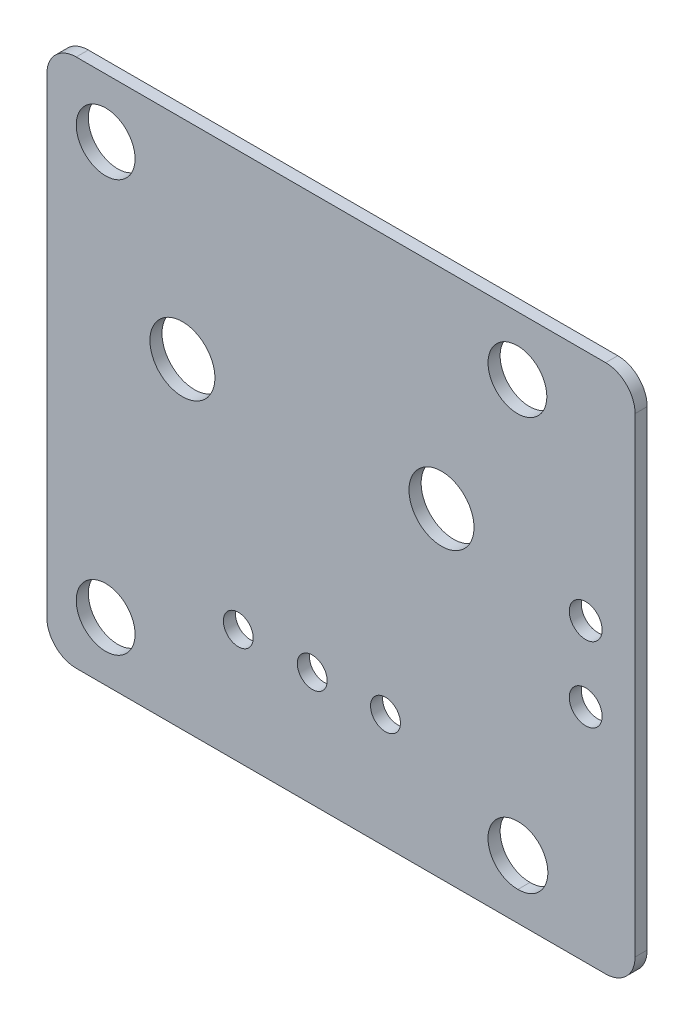
ISO-10303-21;
HEADER;
FILE_DESCRIPTION(('STEP AP214'),'2;1');
FILE_NAME('part.step','',(''),(''),'','','');
FILE_SCHEMA(('AUTOMOTIVE_DESIGN { 1 0 10303 214 1 1 1 1 }'));
ENDSEC;
DATA;
#1=APPLICATION_CONTEXT('core data for automotive mechanical design processes');
#2=APPLICATION_PROTOCOL_DEFINITION('international standard','automotive_design',2000,#1);
#3=PRODUCT_CONTEXT('',#1,'mechanical');
#4=PRODUCT('Part','Part','',(#3));
#5=PRODUCT_RELATED_PRODUCT_CATEGORY('part','',(#4));
#6=PRODUCT_DEFINITION_FORMATION('','',#4);
#7=PRODUCT_DEFINITION_CONTEXT('part definition',#1,'design');
#8=PRODUCT_DEFINITION('design','',#6,#7);
#9=PRODUCT_DEFINITION_SHAPE('','',#8);
#10=(LENGTH_UNIT() NAMED_UNIT(*) SI_UNIT(.MILLI.,.METRE.));
#11=(NAMED_UNIT(*) PLANE_ANGLE_UNIT() SI_UNIT($,.RADIAN.));
#12=(NAMED_UNIT(*) SI_UNIT($,.STERADIAN.) SOLID_ANGLE_UNIT());
#13=UNCERTAINTY_MEASURE_WITH_UNIT(LENGTH_MEASURE(1.E-05),#10,'distance_accuracy_value','');
#14=(GEOMETRIC_REPRESENTATION_CONTEXT(3) GLOBAL_UNCERTAINTY_ASSIGNED_CONTEXT((#13)) GLOBAL_UNIT_ASSIGNED_CONTEXT((#10,
#11,#12)) REPRESENTATION_CONTEXT('',''));
#15=CARTESIAN_POINT('',(0.,0.,0.));
#16=DIRECTION('',(0.,0.,1.));
#17=DIRECTION('',(1.,0.,0.));
#18=AXIS2_PLACEMENT_3D('',#15,#16,#17);
#19=CARTESIAN_POINT('',(-8.99999978,7.99999924,0.41148));
#20=DIRECTION('',(0.,0.,-1.));
#21=DIRECTION('',(-1.,0.,0.));
#22=AXIS2_PLACEMENT_3D('',#19,#20,#21);
#23=CYLINDRICAL_SURFACE('',#22,1.00000054);
#24=CARTESIAN_POINT('',(-8.99999978,7.99999924,0.));
#25=DIRECTION('',(0.,0.,1.));
#26=DIRECTION('',(-1.,0.,0.));
#27=AXIS2_PLACEMENT_3D('',#24,#25,#26);
#28=CIRCLE('',#27,1.00000054);
#29=CARTESIAN_POINT('',(-8.99999978,8.99999978,0.));
#30=VERTEX_POINT('',#29);
#31=CARTESIAN_POINT('',(-10.00000032,7.99999924,0.));
#32=VERTEX_POINT('',#31);
#33=EDGE_CURVE('E154',#30,#32,#28,.T.);
#34=ORIENTED_EDGE('',*,*,#33,.T.);
#35=DIRECTION('',(0.,0.,-1.));
#36=VECTOR('',#35,1.);
#37=CARTESIAN_POINT('',(-10.00000032,7.99999924,0.41148));
#38=LINE('',#37,#36);
#39=CARTESIAN_POINT('',(-10.00000032,7.99999924,0.41148));
#40=VERTEX_POINT('',#39);
#41=EDGE_CURVE('E197',#40,#32,#38,.T.);
#42=ORIENTED_EDGE('',*,*,#41,.F.);
#43=CARTESIAN_POINT('',(-8.99999978,7.99999924,0.41148));
#44=DIRECTION('',(0.,0.,1.));
#45=DIRECTION('',(-1.,0.,0.));
#46=AXIS2_PLACEMENT_3D('',#43,#44,#45);
#47=CIRCLE('',#46,1.00000054);
#48=CARTESIAN_POINT('',(-8.99999978,8.99999978,0.41148));
#49=VERTEX_POINT('',#48);
#50=EDGE_CURVE('E178',#49,#40,#47,.T.);
#51=ORIENTED_EDGE('',*,*,#50,.F.);
#52=DIRECTION('',(0.,0.,-1.));
#53=VECTOR('',#52,1.);
#54=CARTESIAN_POINT('',(-8.99999978,8.99999978,0.41148));
#55=LINE('',#54,#53);
#56=EDGE_CURVE('E150',#49,#30,#55,.T.);
#57=ORIENTED_EDGE('',*,*,#56,.T.);
#58=EDGE_LOOP('',(#34,#42,#51,#57));
#59=FACE_BOUND('',#58,.T.);
#60=ADVANCED_FACE('F41',(#59),#23,.T.);
#61=CARTESIAN_POINT('',(-9.99999778,-7.99999924,0.41148));
#62=DIRECTION('',(0.999999999999987,1.58750015205857E-07,0.));
#63=DIRECTION('',(-1.58750015205857E-07,0.999999999999987,0.));
#64=AXIS2_PLACEMENT_3D('',#61,#62,#63);
#65=PLANE('',#64);
#66=DIRECTION('',(1.58750015205857E-07,-0.999999999999987,0.));
#67=VECTOR('',#66,1.);
#68=CARTESIAN_POINT('',(-9.99999778,-7.99999924,0.));
#69=LINE('',#68,#67);
#70=CARTESIAN_POINT('',(-9.99999778,-7.99999924,0.));
#71=VERTEX_POINT('',#70);
#72=EDGE_CURVE('E158',#32,#71,#69,.T.);
#73=ORIENTED_EDGE('',*,*,#72,.T.);
#74=DIRECTION('',(0.,0.,-1.));
#75=VECTOR('',#74,1.);
#76=CARTESIAN_POINT('',(-9.99999778,-7.99999924,0.41148));
#77=LINE('',#76,#75);
#78=CARTESIAN_POINT('',(-9.99999778,-7.99999924,0.41148));
#79=VERTEX_POINT('',#78);
#80=EDGE_CURVE('E193',#79,#71,#77,.T.);
#81=ORIENTED_EDGE('',*,*,#80,.F.);
#82=DIRECTION('',(1.58750015205857E-07,-0.999999999999987,0.));
#83=VECTOR('',#82,1.);
#84=CARTESIAN_POINT('',(-9.99999778,-7.99999924,0.41148));
#85=LINE('',#84,#83);
#86=EDGE_CURVE('E107',#40,#79,#85,.T.);
#87=ORIENTED_EDGE('',*,*,#86,.F.);
#88=ORIENTED_EDGE('',*,*,#41,.T.);
#89=EDGE_LOOP('',(#73,#81,#87,#88));
#90=FACE_BOUND('',#89,.T.);
#91=ADVANCED_FACE('F245',(#90),#65,.F.);
#92=CARTESIAN_POINT('',(-8.99999978,-7.99999924,0.41148));
#93=DIRECTION('',(0.,0.,-1.));
#94=DIRECTION('',(-1.,0.,0.));
#95=AXIS2_PLACEMENT_3D('',#92,#93,#94);
#96=CYLINDRICAL_SURFACE('',#95,0.999997999999998);
#97=CARTESIAN_POINT('',(-8.99999978,-7.99999924,0.));
#98=DIRECTION('',(0.,0.,1.));
#99=DIRECTION('',(-1.,0.,0.));
#100=AXIS2_PLACEMENT_3D('',#97,#98,#99);
#101=CIRCLE('',#100,0.999997999999998);
#102=CARTESIAN_POINT('',(-8.99999978,-8.99999724,0.));
#103=VERTEX_POINT('',#102);
#104=EDGE_CURVE('E162',#71,#103,#101,.T.);
#105=ORIENTED_EDGE('',*,*,#104,.T.);
#106=DIRECTION('',(0.,0.,-1.));
#107=VECTOR('',#106,1.);
#108=CARTESIAN_POINT('',(-8.99999978,-8.99999724,0.41148));
#109=LINE('',#108,#107);
#110=CARTESIAN_POINT('',(-8.99999978,-8.99999724,0.41148));
#111=VERTEX_POINT('',#110);
#112=EDGE_CURVE('E189',#111,#103,#109,.T.);
#113=ORIENTED_EDGE('',*,*,#112,.F.);
#114=CARTESIAN_POINT('',(-8.99999978,-7.99999924,0.41148));
#115=DIRECTION('',(0.,0.,1.));
#116=DIRECTION('',(-1.,0.,0.));
#117=AXIS2_PLACEMENT_3D('',#114,#115,#116);
#118=CIRCLE('',#117,0.999997999999998);
#119=EDGE_CURVE('E222',#79,#111,#118,.T.);
#120=ORIENTED_EDGE('',*,*,#119,.F.);
#121=ORIENTED_EDGE('',*,*,#80,.T.);
#122=EDGE_LOOP('',(#105,#113,#120,#121));
#123=FACE_BOUND('',#122,.T.);
#124=ADVANCED_FACE('F248',(#123),#96,.T.);
#125=CARTESIAN_POINT('',(8.99999978,-8.99999978,0.41148));
#126=DIRECTION('',(1.41111114671255E-07,0.99999999999999,0.));
#127=DIRECTION('',(-0.99999999999999,1.41111114671255E-07,0.));
#128=AXIS2_PLACEMENT_3D('',#125,#126,#127);
#129=PLANE('',#128);
#130=DIRECTION('',(0.99999999999999,-1.41111114671255E-07,0.));
#131=VECTOR('',#130,1.);
#132=CARTESIAN_POINT('',(8.99999978,-8.99999978,0.));
#133=LINE('',#132,#131);
#134=CARTESIAN_POINT('',(8.99999978,-8.99999978,0.));
#135=VERTEX_POINT('',#134);
#136=EDGE_CURVE('E165',#103,#135,#133,.T.);
#137=ORIENTED_EDGE('',*,*,#136,.T.);
#138=DIRECTION('',(0.,0.,-1.));
#139=VECTOR('',#138,1.);
#140=CARTESIAN_POINT('',(8.99999978,-8.99999978,0.41148));
#141=LINE('',#140,#139);
#142=CARTESIAN_POINT('',(8.99999978,-8.99999978,0.41148));
#143=VERTEX_POINT('',#142);
#144=EDGE_CURVE('E185',#143,#135,#141,.T.);
#145=ORIENTED_EDGE('',*,*,#144,.F.);
#146=DIRECTION('',(0.99999999999999,-1.41111114671255E-07,0.));
#147=VECTOR('',#146,1.);
#148=CARTESIAN_POINT('',(8.99999978,-8.99999978,0.41148));
#149=LINE('',#148,#147);
#150=EDGE_CURVE('E225',#111,#143,#149,.T.);
#151=ORIENTED_EDGE('',*,*,#150,.F.);
#152=ORIENTED_EDGE('',*,*,#112,.T.);
#153=EDGE_LOOP('',(#137,#145,#151,#152));
#154=FACE_BOUND('',#153,.T.);
#155=ADVANCED_FACE('F233',(#154),#129,.F.);
#156=CARTESIAN_POINT('',(8.99999851000081,-8.00000051000081,0.41148));
#157=DIRECTION('',(0.,0.,-1.));
#158=DIRECTION('',(-1.,0.,0.));
#159=AXIS2_PLACEMENT_3D('',#156,#157,#158);
#160=CYLINDRICAL_SURFACE('',#159,0.999999269999999);
#161=CARTESIAN_POINT('',(8.99999851000081,-8.00000051000081,0.));
#162=DIRECTION('',(0.,0.,1.));
#163=DIRECTION('',(-1.,0.,0.));
#164=AXIS2_PLACEMENT_3D('',#161,#162,#163);
#165=CIRCLE('',#164,0.999999269999999);
#166=CARTESIAN_POINT('',(9.99999778,-7.99999924,0.));
#167=VERTEX_POINT('',#166);
#168=EDGE_CURVE('E168',#135,#167,#165,.T.);
#169=ORIENTED_EDGE('',*,*,#168,.T.);
#170=DIRECTION('',(0.,0.,-1.));
#171=VECTOR('',#170,1.);
#172=CARTESIAN_POINT('',(9.99999778,-7.99999924,0.41148));
#173=LINE('',#172,#171);
#174=CARTESIAN_POINT('',(9.99999778,-7.99999924,0.41148));
#175=VERTEX_POINT('',#174);
#176=EDGE_CURVE('E143',#175,#167,#173,.T.);
#177=ORIENTED_EDGE('',*,*,#176,.F.);
#178=CARTESIAN_POINT('',(8.99999851000081,-8.00000051000081,0.41148));
#179=DIRECTION('',(0.,0.,1.));
#180=DIRECTION('',(-1.,0.,0.));
#181=AXIS2_PLACEMENT_3D('',#178,#179,#180);
#182=CIRCLE('',#181,0.999999269999999);
#183=EDGE_CURVE('E129',#143,#175,#182,.T.);
#184=ORIENTED_EDGE('',*,*,#183,.F.);
#185=ORIENTED_EDGE('',*,*,#144,.T.);
#186=EDGE_LOOP('',(#169,#177,#184,#185));
#187=FACE_BOUND('',#186,.T.);
#188=ADVANCED_FACE('F237',(#187),#160,.T.);
#189=CARTESIAN_POINT('',(9.99999778,7.99999924,0.41148));
#190=DIRECTION('',(-1.,0.,0.));
#191=DIRECTION('',(0.,0.,1.));
#192=AXIS2_PLACEMENT_3D('',#189,#190,#191);
#193=PLANE('',#192);
#194=DIRECTION('',(0.,1.,0.));
#195=VECTOR('',#194,1.);
#196=CARTESIAN_POINT('',(9.99999778,7.99999924,0.));
#197=LINE('',#196,#195);
#198=CARTESIAN_POINT('',(9.99999778,7.99999924,0.));
#199=VERTEX_POINT('',#198);
#200=EDGE_CURVE('E139',#167,#199,#197,.T.);
#201=ORIENTED_EDGE('',*,*,#200,.T.);
#202=DIRECTION('',(0.,0.,-1.));
#203=VECTOR('',#202,1.);
#204=CARTESIAN_POINT('',(9.99999778,7.99999924,0.41148));
#205=LINE('',#204,#203);
#206=CARTESIAN_POINT('',(9.99999778,7.99999924,0.41148));
#207=VERTEX_POINT('',#206);
#208=EDGE_CURVE('E136',#207,#199,#205,.T.);
#209=ORIENTED_EDGE('',*,*,#208,.F.);
#210=DIRECTION('',(0.,1.,0.));
#211=VECTOR('',#210,1.);
#212=CARTESIAN_POINT('',(9.99999778,7.99999924,0.41148));
#213=LINE('',#212,#211);
#214=EDGE_CURVE('E122',#175,#207,#213,.T.);
#215=ORIENTED_EDGE('',*,*,#214,.F.);
#216=ORIENTED_EDGE('',*,*,#176,.T.);
#217=EDGE_LOOP('',(#201,#209,#215,#216));
#218=FACE_BOUND('',#217,.T.);
#219=ADVANCED_FACE('F137',(#218),#193,.F.);
#220=CARTESIAN_POINT('',(8.99999978,7.99999924,0.41148));
#221=DIRECTION('',(0.,0.,-1.));
#222=DIRECTION('',(-1.,0.,0.));
#223=AXIS2_PLACEMENT_3D('',#220,#221,#222);
#224=CYLINDRICAL_SURFACE('',#223,0.999997999999998);
#225=CARTESIAN_POINT('',(8.99999978,7.99999924,0.));
#226=DIRECTION('',(0.,0.,1.));
#227=DIRECTION('',(-1.,0.,0.));
#228=AXIS2_PLACEMENT_3D('',#225,#226,#227);
#229=CIRCLE('',#228,0.999997999999998);
#230=CARTESIAN_POINT('',(8.99999978,8.99999724,0.));
#231=VERTEX_POINT('',#230);
#232=EDGE_CURVE('E173',#199,#231,#229,.T.);
#233=ORIENTED_EDGE('',*,*,#232,.T.);
#234=DIRECTION('',(0.,0.,-1.));
#235=VECTOR('',#234,1.);
#236=CARTESIAN_POINT('',(8.99999978,8.99999724,0.41148));
#237=LINE('',#236,#235);
#238=CARTESIAN_POINT('',(8.99999978,8.99999724,0.41148));
#239=VERTEX_POINT('',#238);
#240=EDGE_CURVE('E144',#239,#231,#237,.T.);
#241=ORIENTED_EDGE('',*,*,#240,.F.);
#242=CARTESIAN_POINT('',(8.99999978,7.99999924,0.41148));
#243=DIRECTION('',(0.,0.,1.));
#244=DIRECTION('',(-1.,0.,0.));
#245=AXIS2_PLACEMENT_3D('',#242,#243,#244);
#246=CIRCLE('',#245,0.999997999999998);
#247=EDGE_CURVE('E126',#207,#239,#246,.T.);
#248=ORIENTED_EDGE('',*,*,#247,.F.);
#249=ORIENTED_EDGE('',*,*,#208,.T.);
#250=EDGE_LOOP('',(#233,#241,#248,#249));
#251=FACE_BOUND('',#250,.T.);
#252=ADVANCED_FACE('F146',(#251),#224,.T.);
#253=CARTESIAN_POINT('',(-8.99999978,8.99999978,0.41148));
#254=DIRECTION('',(-1.41111114671255E-07,-0.99999999999999,0.));
#255=DIRECTION('',(0.99999999999999,-1.41111114671255E-07,0.));
#256=AXIS2_PLACEMENT_3D('',#253,#254,#255);
#257=PLANE('',#256);
#258=DIRECTION('',(-0.99999999999999,1.41111114671255E-07,0.));
#259=VECTOR('',#258,1.);
#260=CARTESIAN_POINT('',(-8.99999978,8.99999978,0.));
#261=LINE('',#260,#259);
#262=EDGE_CURVE('E98',#231,#30,#261,.T.);
#263=ORIENTED_EDGE('',*,*,#262,.T.);
#264=ORIENTED_EDGE('',*,*,#56,.F.);
#265=DIRECTION('',(-0.99999999999999,1.41111114671255E-07,0.));
#266=VECTOR('',#265,1.);
#267=CARTESIAN_POINT('',(-8.99999978,8.99999978,0.41148));
#268=LINE('',#267,#266);
#269=EDGE_CURVE('E65',#239,#49,#268,.T.);
#270=ORIENTED_EDGE('',*,*,#269,.F.);
#271=ORIENTED_EDGE('',*,*,#240,.T.);
#272=EDGE_LOOP('',(#263,#264,#270,#271));
#273=FACE_BOUND('',#272,.T.);
#274=ADVANCED_FACE('F241',(#273),#257,.F.);
#275=CARTESIAN_POINT('',(-8.99999978,7.99999924,0.41148));
#276=DIRECTION('',(0.,0.,-1.));
#277=DIRECTION('',(-1.,0.,0.));
#278=AXIS2_PLACEMENT_3D('',#275,#276,#277);
#279=PLANE('',#278);
#280=CARTESIAN_POINT('',(-7.99999924,6.9999987,0.41148));
#281=DIRECTION('',(0.,0.,1.));
#282=DIRECTION('',(1.,0.,0.));
#283=AXIS2_PLACEMENT_3D('',#280,#281,#282);
#284=CIRCLE('',#283,0.999998);
#285=CARTESIAN_POINT('',(-7.00000124,6.9999987,0.41148));
#286=VERTEX_POINT('',#285);
#287=EDGE_CURVE('E450',#286,#286,#284,.T.);
#288=ORIENTED_EDGE('',*,*,#287,.F.);
#289=EDGE_LOOP('',(#288));
#290=FACE_BOUND('',#289,.T.);
#291=CARTESIAN_POINT('',(-7.99999924,-6.9999987,0.41148));
#292=DIRECTION('',(0.,0.,1.));
#293=DIRECTION('',(1.,0.,0.));
#294=AXIS2_PLACEMENT_3D('',#291,#292,#293);
#295=CIRCLE('',#294,0.999998);
#296=CARTESIAN_POINT('',(-7.00000124,-6.9999987,0.41148));
#297=VERTEX_POINT('',#296);
#298=EDGE_CURVE('E454',#297,#297,#295,.T.);
#299=ORIENTED_EDGE('',*,*,#298,.F.);
#300=EDGE_LOOP('',(#299));
#301=FACE_BOUND('',#300,.T.);
#302=CARTESIAN_POINT('',(5.99999816,6.9999987,0.41148));
#303=DIRECTION('',(0.,0.,1.));
#304=DIRECTION('',(1.,0.,0.));
#305=AXIS2_PLACEMENT_3D('',#302,#303,#304);
#306=CIRCLE('',#305,0.999998);
#307=CARTESIAN_POINT('',(6.99999616,6.9999987,0.41148));
#308=VERTEX_POINT('',#307);
#309=EDGE_CURVE('E467',#308,#308,#306,.T.);
#310=ORIENTED_EDGE('',*,*,#309,.F.);
#311=EDGE_LOOP('',(#310));
#312=FACE_BOUND('',#311,.T.);
#313=CARTESIAN_POINT('',(1.51380444,-5.1019964,0.411480000000006));
#314=DIRECTION('',(0.,0.,-1.));
#315=DIRECTION('',(-1.,0.,0.));
#316=AXIS2_PLACEMENT_3D('',#313,#314,#315);
#317=CIRCLE('',#316,0.507999999999987);
#318=CARTESIAN_POINT('',(1.00580444000001,-5.1019964,0.411480000000006));
#319=VERTEX_POINT('',#318);
#320=EDGE_CURVE('E481',#319,#319,#317,.T.);
#321=ORIENTED_EDGE('',*,*,#320,.T.);
#322=EDGE_LOOP('',(#321));
#323=FACE_BOUND('',#322,.T.);
#324=CARTESIAN_POINT('',(-0.97539556,-5.1019964,0.411480000000006));
#325=DIRECTION('',(0.,0.,-1.));
#326=DIRECTION('',(-1.,0.,0.));
#327=AXIS2_PLACEMENT_3D('',#324,#325,#326);
#328=CIRCLE('',#327,0.507999999999987);
#329=CARTESIAN_POINT('',(-1.48339555999999,-5.1019964,0.411480000000006));
#330=VERTEX_POINT('',#329);
#331=EDGE_CURVE('E489',#330,#330,#328,.T.);
#332=ORIENTED_EDGE('',*,*,#331,.T.);
#333=EDGE_LOOP('',(#332));
#334=FACE_BOUND('',#333,.T.);
#335=CARTESIAN_POINT('',(-3.48999556,-5.1019964,0.411480000000006));
#336=DIRECTION('',(0.,0.,-1.));
#337=DIRECTION('',(-1.,0.,0.));
#338=AXIS2_PLACEMENT_3D('',#335,#336,#337);
#339=CIRCLE('',#338,0.507999999999987);
#340=CARTESIAN_POINT('',(-3.99799555999999,-5.1019964,0.411480000000006));
#341=VERTEX_POINT('',#340);
#342=EDGE_CURVE('E497',#341,#341,#339,.T.);
#343=ORIENTED_EDGE('',*,*,#342,.T.);
#344=EDGE_LOOP('',(#343));
#345=FACE_BOUND('',#344,.T.);
#346=CARTESIAN_POINT('',(3.41880444,1.9084036,0.411480000000006));
#347=DIRECTION('',(0.,0.,-1.));
#348=DIRECTION('',(-1.,0.,0.));
#349=AXIS2_PLACEMENT_3D('',#346,#347,#348);
#350=CIRCLE('',#349,1.10489999999999);
#351=CARTESIAN_POINT('',(2.31390444000001,1.9084036,0.411480000000006));
#352=VERTEX_POINT('',#351);
#353=EDGE_CURVE('E505',#352,#352,#350,.T.);
#354=ORIENTED_EDGE('',*,*,#353,.T.);
#355=EDGE_LOOP('',(#354));
#356=FACE_BOUND('',#355,.T.);
#357=CARTESIAN_POINT('',(-5.3899943,1.9084036,0.411480000000006));
#358=DIRECTION('',(0.,0.,-1.));
#359=DIRECTION('',(-1.,0.,0.));
#360=AXIS2_PLACEMENT_3D('',#357,#358,#359);
#361=CIRCLE('',#360,1.10489999999999);
#362=CARTESIAN_POINT('',(-6.49489429999999,1.9084036,0.411480000000006));
#363=VERTEX_POINT('',#362);
#364=EDGE_CURVE('E513',#363,#363,#361,.T.);
#365=ORIENTED_EDGE('',*,*,#364,.T.);
#366=EDGE_LOOP('',(#365));
#367=FACE_BOUND('',#366,.T.);
#368=CARTESIAN_POINT('',(8.32100444,1.06600244,0.411480000000006));
#369=DIRECTION('',(0.,0.,-1.));
#370=DIRECTION('',(-1.,0.,0.));
#371=AXIS2_PLACEMENT_3D('',#368,#369,#370);
#372=CIRCLE('',#371,0.558799999999988);
#373=CARTESIAN_POINT('',(7.76220444000001,1.06600244,0.411480000000006));
#374=VERTEX_POINT('',#373);
#375=EDGE_CURVE('E521',#374,#374,#372,.T.);
#376=ORIENTED_EDGE('',*,*,#375,.T.);
#377=EDGE_LOOP('',(#376));
#378=FACE_BOUND('',#377,.T.);
#379=CARTESIAN_POINT('',(8.32100444,-1.47399756,0.411480000000006));
#380=DIRECTION('',(0.,0.,-1.));
#381=DIRECTION('',(-1.,0.,0.));
#382=AXIS2_PLACEMENT_3D('',#379,#380,#381);
#383=CIRCLE('',#382,0.558799999999988);
#384=CARTESIAN_POINT('',(7.76220444000001,-1.47399756,0.411480000000006));
#385=VERTEX_POINT('',#384);
#386=EDGE_CURVE('E214',#385,#385,#383,.T.);
#387=ORIENTED_EDGE('',*,*,#386,.T.);
#388=EDGE_LOOP('',(#387));
#389=FACE_BOUND('',#388,.T.);
#390=CARTESIAN_POINT('',(6.03500444,-6.9999987,0.411480000000006));
#391=DIRECTION('',(0.,0.,-1.));
#392=DIRECTION('',(-1.,0.,0.));
#393=AXIS2_PLACEMENT_3D('',#390,#391,#392);
#394=CIRCLE('',#393,1.00000053999999);
#395=CARTESIAN_POINT('',(6.0174287416438,-6.00015262443259,0.41148));
#396=VERTEX_POINT('',#395);
#397=CARTESIAN_POINT('',(6.0174287416438,-7.99984477556741,0.411480000000006));
#398=VERTEX_POINT('',#397);
#399=EDGE_CURVE('E159',#396,#398,#394,.T.);
#400=ORIENTED_EDGE('',*,*,#399,.T.);
#401=CARTESIAN_POINT('',(5.99999816,-6.9999987,0.41148));
#402=DIRECTION('',(0.,0.,1.));
#403=DIRECTION('',(1.,0.,0.));
#404=AXIS2_PLACEMENT_3D('',#401,#402,#403);
#405=CIRCLE('',#404,0.999998);
#406=EDGE_CURVE('E56',#396,#398,#405,.T.);
#407=ORIENTED_EDGE('',*,*,#406,.F.);
#408=EDGE_LOOP('',(#400,#407));
#409=FACE_BOUND('',#408,.T.);
#410=ORIENTED_EDGE('',*,*,#50,.T.);
#411=ORIENTED_EDGE('',*,*,#86,.T.);
#412=ORIENTED_EDGE('',*,*,#119,.T.);
#413=ORIENTED_EDGE('',*,*,#150,.T.);
#414=ORIENTED_EDGE('',*,*,#183,.T.);
#415=ORIENTED_EDGE('',*,*,#214,.T.);
#416=ORIENTED_EDGE('',*,*,#247,.T.);
#417=ORIENTED_EDGE('',*,*,#269,.T.);
#418=EDGE_LOOP('',(#410,#411,#412,#413,#414,#415,#416,#417));
#419=FACE_BOUND('',#418,.T.);
#420=ADVANCED_FACE('F124',(#290,#301,#312,#323,#334,#345,#356,#367,#378,#389,#409,#419),#279,.F.);
#421=CARTESIAN_POINT('',(-8.99999978,7.99999924,0.));
#422=DIRECTION('',(0.,0.,-1.));
#423=DIRECTION('',(-1.,0.,0.));
#424=AXIS2_PLACEMENT_3D('',#421,#422,#423);
#425=PLANE('',#424);
#426=CARTESIAN_POINT('',(-7.99999924,6.9999987,0.));
#427=DIRECTION('',(0.,0.,1.));
#428=DIRECTION('',(1.,0.,0.));
#429=AXIS2_PLACEMENT_3D('',#426,#427,#428);
#430=CIRCLE('',#429,0.999998);
#431=CARTESIAN_POINT('',(-7.00000124,6.9999987,0.));
#432=VERTEX_POINT('',#431);
#433=EDGE_CURVE('E447',#432,#432,#430,.T.);
#434=ORIENTED_EDGE('',*,*,#433,.T.);
#435=EDGE_LOOP('',(#434));
#436=FACE_BOUND('',#435,.T.);
#437=CARTESIAN_POINT('',(-7.99999924,-6.9999987,0.));
#438=DIRECTION('',(0.,0.,1.));
#439=DIRECTION('',(1.,0.,0.));
#440=AXIS2_PLACEMENT_3D('',#437,#438,#439);
#441=CIRCLE('',#440,0.999998);
#442=CARTESIAN_POINT('',(-7.00000124,-6.9999987,0.));
#443=VERTEX_POINT('',#442);
#444=EDGE_CURVE('E457',#443,#443,#441,.T.);
#445=ORIENTED_EDGE('',*,*,#444,.T.);
#446=EDGE_LOOP('',(#445));
#447=FACE_BOUND('',#446,.T.);
#448=CARTESIAN_POINT('',(5.99999816,-6.9999987,0.));
#449=DIRECTION('',(0.,0.,1.));
#450=DIRECTION('',(1.,0.,0.));
#451=AXIS2_PLACEMENT_3D('',#448,#449,#450);
#452=CIRCLE('',#451,0.999998);
#453=CARTESIAN_POINT('',(6.0174287416438,-6.00015262443259,0.));
#454=VERTEX_POINT('',#453);
#455=CARTESIAN_POINT('',(6.0174287416438,-7.99984477556741,0.));
#456=VERTEX_POINT('',#455);
#457=EDGE_CURVE('E464',#454,#456,#452,.T.);
#458=ORIENTED_EDGE('',*,*,#457,.T.);
#459=CARTESIAN_POINT('',(6.03500444,-6.9999987,0.));
#460=DIRECTION('',(0.,0.,-1.));
#461=DIRECTION('',(-1.,0.,0.));
#462=AXIS2_PLACEMENT_3D('',#459,#460,#461);
#463=CIRCLE('',#462,1.00000053999999);
#464=EDGE_CURVE('E207',#454,#456,#463,.T.);
#465=ORIENTED_EDGE('',*,*,#464,.F.);
#466=EDGE_LOOP('',(#458,#465));
#467=FACE_BOUND('',#466,.T.);
#468=CARTESIAN_POINT('',(5.99999816,6.9999987,0.));
#469=DIRECTION('',(0.,0.,1.));
#470=DIRECTION('',(1.,0.,0.));
#471=AXIS2_PLACEMENT_3D('',#468,#469,#470);
#472=CIRCLE('',#471,0.999998);
#473=CARTESIAN_POINT('',(6.99999616,6.9999987,0.));
#474=VERTEX_POINT('',#473);
#475=EDGE_CURVE('E470',#474,#474,#472,.T.);
#476=ORIENTED_EDGE('',*,*,#475,.T.);
#477=EDGE_LOOP('',(#476));
#478=FACE_BOUND('',#477,.T.);
#479=CARTESIAN_POINT('',(1.51380444,-5.1019964,0.));
#480=DIRECTION('',(0.,0.,-1.));
#481=DIRECTION('',(-1.,0.,0.));
#482=AXIS2_PLACEMENT_3D('',#479,#480,#481);
#483=CIRCLE('',#482,0.507999999999987);
#484=CARTESIAN_POINT('',(1.00580444000001,-5.1019964,0.));
#485=VERTEX_POINT('',#484);
#486=EDGE_CURVE('E474',#485,#485,#483,.T.);
#487=ORIENTED_EDGE('',*,*,#486,.F.);
#488=EDGE_LOOP('',(#487));
#489=FACE_BOUND('',#488,.T.);
#490=CARTESIAN_POINT('',(-0.97539556,-5.1019964,0.));
#491=DIRECTION('',(0.,0.,-1.));
#492=DIRECTION('',(-1.,0.,0.));
#493=AXIS2_PLACEMENT_3D('',#490,#491,#492);
#494=CIRCLE('',#493,0.507999999999988);
#495=CARTESIAN_POINT('',(-1.48339555999999,-5.1019964,0.));
#496=VERTEX_POINT('',#495);
#497=EDGE_CURVE('E485',#496,#496,#494,.T.);
#498=ORIENTED_EDGE('',*,*,#497,.F.);
#499=EDGE_LOOP('',(#498));
#500=FACE_BOUND('',#499,.T.);
#501=CARTESIAN_POINT('',(-3.48999556,-5.1019964,0.));
#502=DIRECTION('',(0.,0.,-1.));
#503=DIRECTION('',(-1.,0.,0.));
#504=AXIS2_PLACEMENT_3D('',#501,#502,#503);
#505=CIRCLE('',#504,0.507999999999988);
#506=CARTESIAN_POINT('',(-3.99799555999999,-5.1019964,0.));
#507=VERTEX_POINT('',#506);
#508=EDGE_CURVE('E493',#507,#507,#505,.T.);
#509=ORIENTED_EDGE('',*,*,#508,.F.);
#510=EDGE_LOOP('',(#509));
#511=FACE_BOUND('',#510,.T.);
#512=CARTESIAN_POINT('',(3.41880444,1.9084036,0.));
#513=DIRECTION('',(0.,0.,-1.));
#514=DIRECTION('',(-1.,0.,0.));
#515=AXIS2_PLACEMENT_3D('',#512,#513,#514);
#516=CIRCLE('',#515,1.10489999999999);
#517=CARTESIAN_POINT('',(2.31390444000001,1.9084036,0.));
#518=VERTEX_POINT('',#517);
#519=EDGE_CURVE('E501',#518,#518,#516,.T.);
#520=ORIENTED_EDGE('',*,*,#519,.F.);
#521=EDGE_LOOP('',(#520));
#522=FACE_BOUND('',#521,.T.);
#523=CARTESIAN_POINT('',(-5.3899943,1.9084036,0.));
#524=DIRECTION('',(0.,0.,-1.));
#525=DIRECTION('',(-1.,0.,0.));
#526=AXIS2_PLACEMENT_3D('',#523,#524,#525);
#527=CIRCLE('',#526,1.10489999999999);
#528=CARTESIAN_POINT('',(-6.49489429999999,1.9084036,0.));
#529=VERTEX_POINT('',#528);
#530=EDGE_CURVE('E509',#529,#529,#527,.T.);
#531=ORIENTED_EDGE('',*,*,#530,.F.);
#532=EDGE_LOOP('',(#531));
#533=FACE_BOUND('',#532,.T.);
#534=CARTESIAN_POINT('',(8.32100444,1.06600244,0.));
#535=DIRECTION('',(0.,0.,-1.));
#536=DIRECTION('',(-1.,0.,0.));
#537=AXIS2_PLACEMENT_3D('',#534,#535,#536);
#538=CIRCLE('',#537,0.558799999999988);
#539=CARTESIAN_POINT('',(7.76220444000001,1.06600244,0.));
#540=VERTEX_POINT('',#539);
#541=EDGE_CURVE('E517',#540,#540,#538,.T.);
#542=ORIENTED_EDGE('',*,*,#541,.F.);
#543=EDGE_LOOP('',(#542));
#544=FACE_BOUND('',#543,.T.);
#545=CARTESIAN_POINT('',(8.32100444,-1.47399756,0.));
#546=DIRECTION('',(0.,0.,-1.));
#547=DIRECTION('',(-1.,0.,0.));
#548=AXIS2_PLACEMENT_3D('',#545,#546,#547);
#549=CIRCLE('',#548,0.558799999999988);
#550=CARTESIAN_POINT('',(7.76220444000001,-1.47399756,0.));
#551=VERTEX_POINT('',#550);
#552=EDGE_CURVE('E525',#551,#551,#549,.T.);
#553=ORIENTED_EDGE('',*,*,#552,.F.);
#554=EDGE_LOOP('',(#553));
#555=FACE_BOUND('',#554,.T.);
#556=ORIENTED_EDGE('',*,*,#33,.F.);
#557=ORIENTED_EDGE('',*,*,#262,.F.);
#558=ORIENTED_EDGE('',*,*,#232,.F.);
#559=ORIENTED_EDGE('',*,*,#200,.F.);
#560=ORIENTED_EDGE('',*,*,#168,.F.);
#561=ORIENTED_EDGE('',*,*,#136,.F.);
#562=ORIENTED_EDGE('',*,*,#104,.F.);
#563=ORIENTED_EDGE('',*,*,#72,.F.);
#564=EDGE_LOOP('',(#556,#557,#558,#559,#560,#561,#562,#563));
#565=FACE_BOUND('',#564,.T.);
#566=ADVANCED_FACE('F240',(#436,#447,#467,#478,#489,#500,#511,#522,#533,#544,#555,#565),#425,.T.);
#567=CARTESIAN_POINT('',(6.03500444,-6.9999987,0.));
#568=DIRECTION('',(0.,0.,-1.));
#569=DIRECTION('',(-1.,0.,0.));
#570=AXIS2_PLACEMENT_3D('',#567,#568,#569);
#571=CYLINDRICAL_SURFACE('',#570,1.00000053999999);
#572=ORIENTED_EDGE('',*,*,#399,.F.);
#573=DIRECTION('',(0.,0.,1.));
#574=VECTOR('',#573,1.);
#575=CARTESIAN_POINT('',(6.0174287416438,-6.00015262443259,0.205739999999999));
#576=LINE('',#575,#574);
#577=EDGE_CURVE('E11',#396,#454,#576,.F.);
#578=ORIENTED_EDGE('',*,*,#577,.T.);
#579=ORIENTED_EDGE('',*,*,#464,.T.);
#580=DIRECTION('',(0.,0.,1.));
#581=VECTOR('',#580,1.);
#582=CARTESIAN_POINT('',(6.0174287416438,-7.99984477556741,0.205739999999999));
#583=LINE('',#582,#581);
#584=EDGE_CURVE('E49',#456,#398,#583,.T.);
#585=ORIENTED_EDGE('',*,*,#584,.T.);
#586=EDGE_LOOP('',(#572,#578,#579,#585));
#587=FACE_BOUND('',#586,.T.);
#588=ADVANCED_FACE('F204',(#587),#571,.F.);
#589=CARTESIAN_POINT('',(8.32100444,-1.47399756,0.));
#590=DIRECTION('',(0.,0.,-1.));
#591=DIRECTION('',(-1.,0.,0.));
#592=AXIS2_PLACEMENT_3D('',#589,#590,#591);
#593=CYLINDRICAL_SURFACE('',#592,0.558799999999988);
#594=ORIENTED_EDGE('',*,*,#386,.F.);
#595=EDGE_LOOP('',(#594));
#596=FACE_BOUND('',#595,.T.);
#597=ORIENTED_EDGE('',*,*,#552,.T.);
#598=EDGE_LOOP('',(#597));
#599=FACE_BOUND('',#598,.T.);
#600=ADVANCED_FACE('F312',(#596,#599),#593,.F.);
#601=CARTESIAN_POINT('',(8.32100444,1.06600244,0.));
#602=DIRECTION('',(0.,0.,-1.));
#603=DIRECTION('',(-1.,0.,0.));
#604=AXIS2_PLACEMENT_3D('',#601,#602,#603);
#605=CYLINDRICAL_SURFACE('',#604,0.558799999999988);
#606=ORIENTED_EDGE('',*,*,#375,.F.);
#607=EDGE_LOOP('',(#606));
#608=FACE_BOUND('',#607,.T.);
#609=ORIENTED_EDGE('',*,*,#541,.T.);
#610=EDGE_LOOP('',(#609));
#611=FACE_BOUND('',#610,.T.);
#612=ADVANCED_FACE('F317',(#608,#611),#605,.F.);
#613=CARTESIAN_POINT('',(-5.3899943,1.9084036,0.));
#614=DIRECTION('',(0.,0.,-1.));
#615=DIRECTION('',(-1.,0.,0.));
#616=AXIS2_PLACEMENT_3D('',#613,#614,#615);
#617=CYLINDRICAL_SURFACE('',#616,1.10489999999999);
#618=ORIENTED_EDGE('',*,*,#364,.F.);
#619=EDGE_LOOP('',(#618));
#620=FACE_BOUND('',#619,.T.);
#621=ORIENTED_EDGE('',*,*,#530,.T.);
#622=EDGE_LOOP('',(#621));
#623=FACE_BOUND('',#622,.T.);
#624=ADVANCED_FACE('F329',(#620,#623),#617,.F.);
#625=CARTESIAN_POINT('',(3.41880444,1.9084036,0.));
#626=DIRECTION('',(0.,0.,-1.));
#627=DIRECTION('',(-1.,0.,0.));
#628=AXIS2_PLACEMENT_3D('',#625,#626,#627);
#629=CYLINDRICAL_SURFACE('',#628,1.10489999999999);
#630=ORIENTED_EDGE('',*,*,#353,.F.);
#631=EDGE_LOOP('',(#630));
#632=FACE_BOUND('',#631,.T.);
#633=ORIENTED_EDGE('',*,*,#519,.T.);
#634=EDGE_LOOP('',(#633));
#635=FACE_BOUND('',#634,.T.);
#636=ADVANCED_FACE('F339',(#632,#635),#629,.F.);
#637=CARTESIAN_POINT('',(-3.48999556,-5.1019964,0.));
#638=DIRECTION('',(0.,0.,-1.));
#639=DIRECTION('',(-1.,0.,0.));
#640=AXIS2_PLACEMENT_3D('',#637,#638,#639);
#641=CYLINDRICAL_SURFACE('',#640,0.507999999999987);
#642=ORIENTED_EDGE('',*,*,#342,.F.);
#643=EDGE_LOOP('',(#642));
#644=FACE_BOUND('',#643,.T.);
#645=ORIENTED_EDGE('',*,*,#508,.T.);
#646=EDGE_LOOP('',(#645));
#647=FACE_BOUND('',#646,.T.);
#648=ADVANCED_FACE('F349',(#644,#647),#641,.F.);
#649=CARTESIAN_POINT('',(-0.97539556,-5.1019964,0.));
#650=DIRECTION('',(0.,0.,-1.));
#651=DIRECTION('',(-1.,0.,0.));
#652=AXIS2_PLACEMENT_3D('',#649,#650,#651);
#653=CYLINDRICAL_SURFACE('',#652,0.507999999999988);
#654=ORIENTED_EDGE('',*,*,#331,.F.);
#655=EDGE_LOOP('',(#654));
#656=FACE_BOUND('',#655,.T.);
#657=ORIENTED_EDGE('',*,*,#497,.T.);
#658=EDGE_LOOP('',(#657));
#659=FACE_BOUND('',#658,.T.);
#660=ADVANCED_FACE('F359',(#656,#659),#653,.F.);
#661=CARTESIAN_POINT('',(1.51380444,-5.1019964,0.));
#662=DIRECTION('',(0.,0.,-1.));
#663=DIRECTION('',(-1.,0.,0.));
#664=AXIS2_PLACEMENT_3D('',#661,#662,#663);
#665=CYLINDRICAL_SURFACE('',#664,0.507999999999987);
#666=ORIENTED_EDGE('',*,*,#320,.F.);
#667=EDGE_LOOP('',(#666));
#668=FACE_BOUND('',#667,.T.);
#669=ORIENTED_EDGE('',*,*,#486,.T.);
#670=EDGE_LOOP('',(#669));
#671=FACE_BOUND('',#670,.T.);
#672=ADVANCED_FACE('F369',(#668,#671),#665,.F.);
#673=CARTESIAN_POINT('',(5.99999816,6.9999987,0.));
#674=DIRECTION('',(0.,0.,1.));
#675=DIRECTION('',(1.,0.,0.));
#676=AXIS2_PLACEMENT_3D('',#673,#674,#675);
#677=CYLINDRICAL_SURFACE('',#676,0.999998);
#678=CARTESIAN_POINT('',(6.99999616,6.9999987,0.));
#679=CARTESIAN_POINT('',(6.99999616,6.9999987,0.00428624999999849));
#680=CARTESIAN_POINT('',(6.99999616,6.9999987,0.00857249999999852));
#681=CARTESIAN_POINT('',(6.99999616,6.9999987,0.0171449999999985));
#682=CARTESIAN_POINT('',(6.99999616,6.9999987,0.0214312499999986));
#683=CARTESIAN_POINT('',(6.99999616,6.9999987,0.0300037499999986));
#684=CARTESIAN_POINT('',(6.99999616,6.9999987,0.0342899999999986));
#685=CARTESIAN_POINT('',(6.99999616,6.9999987,0.0428624999999986));
#686=CARTESIAN_POINT('',(6.99999616,6.9999987,0.0471487499999987));
#687=CARTESIAN_POINT('',(6.99999616,6.9999987,0.0557212499999987));
#688=CARTESIAN_POINT('',(6.99999616,6.9999987,0.0600074999999987));
#689=CARTESIAN_POINT('',(6.99999616,6.9999987,0.0685799999999987));
#690=CARTESIAN_POINT('',(6.99999616,6.9999987,0.0728662499999987));
#691=CARTESIAN_POINT('',(6.99999616,6.9999987,0.0814387499999988));
#692=CARTESIAN_POINT('',(6.99999616,6.9999987,0.0857249999999988));
#693=CARTESIAN_POINT('',(6.99999616,6.9999987,0.0942974999999988));
#694=CARTESIAN_POINT('',(6.99999616,6.9999987,0.0985837499999989));
#695=CARTESIAN_POINT('',(6.99999616,6.9999987,0.107156249999999));
#696=CARTESIAN_POINT('',(6.99999616,6.9999987,0.111442499999999));
#697=CARTESIAN_POINT('',(6.99999616,6.9999987,0.120014999999999));
#698=CARTESIAN_POINT('',(6.99999616,6.9999987,0.124301249999999));
#699=CARTESIAN_POINT('',(6.99999616,6.9999987,0.132873749999999));
#700=CARTESIAN_POINT('',(6.99999616,6.9999987,0.137159999999999));
#701=CARTESIAN_POINT('',(6.99999616,6.9999987,0.145732499999999));
#702=CARTESIAN_POINT('',(6.99999616,6.9999987,0.150018749999999));
#703=CARTESIAN_POINT('',(6.99999616,6.9999987,0.158591249999999));
#704=CARTESIAN_POINT('',(6.99999616,6.9999987,0.162877499999999));
#705=CARTESIAN_POINT('',(6.99999616,6.9999987,0.171449999999999));
#706=CARTESIAN_POINT('',(6.99999616,6.9999987,0.175736249999999));
#707=CARTESIAN_POINT('',(6.99999616,6.9999987,0.184308749999999));
#708=CARTESIAN_POINT('',(6.99999616,6.9999987,0.188594999999999));
#709=CARTESIAN_POINT('',(6.99999616,6.9999987,0.197167499999999));
#710=CARTESIAN_POINT('',(6.99999616,6.9999987,0.201453749999999));
#711=CARTESIAN_POINT('',(6.99999616,6.9999987,0.210026249999999));
#712=CARTESIAN_POINT('',(6.99999616,6.9999987,0.214312499999999));
#713=CARTESIAN_POINT('',(6.99999616,6.9999987,0.222884999999999));
#714=CARTESIAN_POINT('',(6.99999616,6.9999987,0.227171249999999));
#715=CARTESIAN_POINT('',(6.99999616,6.9999987,0.235743749999999));
#716=CARTESIAN_POINT('',(6.99999616,6.9999987,0.240029999999999));
#717=CARTESIAN_POINT('',(6.99999616,6.9999987,0.248602499999999));
#718=CARTESIAN_POINT('',(6.99999616,6.9999987,0.252888749999999));
#719=CARTESIAN_POINT('',(6.99999616,6.9999987,0.261461249999999));
#720=CARTESIAN_POINT('',(6.99999616,6.9999987,0.265747499999999));
#721=CARTESIAN_POINT('',(6.99999616,6.9999987,0.27432));
#722=CARTESIAN_POINT('',(6.99999616,6.9999987,0.27860625));
#723=CARTESIAN_POINT('',(6.99999616,6.9999987,0.28717875));
#724=CARTESIAN_POINT('',(6.99999616,6.9999987,0.291465));
#725=CARTESIAN_POINT('',(6.99999616,6.9999987,0.3000375));
#726=CARTESIAN_POINT('',(6.99999616,6.9999987,0.30432375));
#727=CARTESIAN_POINT('',(6.99999616,6.9999987,0.31289625));
#728=CARTESIAN_POINT('',(6.99999616,6.9999987,0.3171825));
#729=CARTESIAN_POINT('',(6.99999616,6.9999987,0.325755));
#730=CARTESIAN_POINT('',(6.99999616,6.9999987,0.33004125));
#731=CARTESIAN_POINT('',(6.99999616,6.9999987,0.33861375));
#732=CARTESIAN_POINT('',(6.99999616,6.9999987,0.3429));
#733=CARTESIAN_POINT('',(6.99999616,6.9999987,0.3514725));
#734=CARTESIAN_POINT('',(6.99999616,6.9999987,0.35575875));
#735=CARTESIAN_POINT('',(6.99999616,6.9999987,0.36433125));
#736=CARTESIAN_POINT('',(6.99999616,6.9999987,0.3686175));
#737=CARTESIAN_POINT('',(6.99999616,6.9999987,0.37719));
#738=CARTESIAN_POINT('',(6.99999616,6.9999987,0.38147625));
#739=CARTESIAN_POINT('',(6.99999616,6.9999987,0.39004875));
#740=CARTESIAN_POINT('',(6.99999616,6.9999987,0.394335));
#741=CARTESIAN_POINT('',(6.99999616,6.9999987,0.4029075));
#742=CARTESIAN_POINT('',(6.99999616,6.9999987,0.40719375));
#743=CARTESIAN_POINT('',(6.99999616,6.9999987,0.41148));
#744=B_SPLINE_CURVE_WITH_KNOTS('',3,(#678,#679,#680,#681,#682,#683,#684,#685,#686,#687,#688,
#689,#690,#691,#692,#693,#694,#695,#696,#697,#698,#699,#700,#701,#702,#703,#704,#705,#706,#707,
#708,#709,#710,#711,#712,#713,#714,#715,#716,#717,#718,#719,#720,#721,#722,#723,#724,#725,#726,
#727,#728,#729,#730,#731,#732,#733,#734,#735,#736,#737,#738,#739,#740,#741,#742,#743),
.UNSPECIFIED.,.F.,.F.,(4,2,2,2,2,2,2,2,2,2,2,2,2,2,2,2,2,2,2,2,2,2,2,2,2,2,2,2,2,2,2,2,4),(0.,
0.01285875,0.0257175000000001,0.0385762500000001,0.0514350000000002,0.0642937500000002,
0.0771525000000003,0.0900112500000003,0.10287,0.11572875,0.1285875,0.141446250000001,
0.154305000000001,0.167163750000001,0.180022500000001,0.192881250000001,0.205740000000001,
0.218598750000001,0.231457500000001,0.244316250000001,0.257175000000001,0.270033750000001,
0.282892500000001,0.295751250000001,0.308610000000001,0.321468750000001,0.334327500000001,
0.347186250000001,0.360045000000001,0.372903750000001,0.385762500000001,0.398621250000001,
0.411480000000002),.UNSPECIFIED.);
#745=EDGE_CURVE('BSEAM379',#474,#308,#744,.T.);
#746=ORIENTED_EDGE('',*,*,#475,.F.);
#747=ORIENTED_EDGE('',*,*,#309,.T.);
#748=ORIENTED_EDGE('',*,*,#745,.T.);
#749=ORIENTED_EDGE('',*,*,#745,.F.);
#750=EDGE_LOOP('',(#746,#748,#747,#749));
#751=FACE_BOUND('',#750,.T.);
#752=ADVANCED_FACE('F379',(#751),#677,.F.);
#753=CARTESIAN_POINT('',(5.99999816,-6.9999987,0.));
#754=DIRECTION('',(0.,0.,1.));
#755=DIRECTION('',(1.,0.,0.));
#756=AXIS2_PLACEMENT_3D('',#753,#754,#755);
#757=CYLINDRICAL_SURFACE('',#756,0.999998);
#758=ORIENTED_EDGE('',*,*,#406,.T.);
#759=ORIENTED_EDGE('',*,*,#584,.F.);
#760=ORIENTED_EDGE('',*,*,#457,.F.);
#761=ORIENTED_EDGE('',*,*,#577,.F.);
#762=EDGE_LOOP('',(#758,#759,#760,#761));
#763=FACE_BOUND('',#762,.T.);
#764=ADVANCED_FACE('F389',(#763),#757,.F.);
#765=CARTESIAN_POINT('',(-7.99999924,-6.9999987,0.));
#766=DIRECTION('',(0.,0.,1.));
#767=DIRECTION('',(1.,0.,0.));
#768=AXIS2_PLACEMENT_3D('',#765,#766,#767);
#769=CYLINDRICAL_SURFACE('',#768,0.999998);
#770=CARTESIAN_POINT('',(-7.00000124,-6.9999987,0.));
#771=CARTESIAN_POINT('',(-7.00000124,-6.9999987,0.00428624999999849));
#772=CARTESIAN_POINT('',(-7.00000124,-6.9999987,0.00857249999999852));
#773=CARTESIAN_POINT('',(-7.00000124,-6.9999987,0.0171449999999985));
#774=CARTESIAN_POINT('',(-7.00000124,-6.9999987,0.0214312499999986));
#775=CARTESIAN_POINT('',(-7.00000124,-6.9999987,0.0300037499999986));
#776=CARTESIAN_POINT('',(-7.00000124,-6.9999987,0.0342899999999986));
#777=CARTESIAN_POINT('',(-7.00000124,-6.9999987,0.0428624999999986));
#778=CARTESIAN_POINT('',(-7.00000124,-6.9999987,0.0471487499999987));
#779=CARTESIAN_POINT('',(-7.00000124,-6.9999987,0.0557212499999987));
#780=CARTESIAN_POINT('',(-7.00000124,-6.9999987,0.0600074999999987));
#781=CARTESIAN_POINT('',(-7.00000124,-6.9999987,0.0685799999999987));
#782=CARTESIAN_POINT('',(-7.00000124,-6.9999987,0.0728662499999987));
#783=CARTESIAN_POINT('',(-7.00000124,-6.9999987,0.0814387499999988));
#784=CARTESIAN_POINT('',(-7.00000124,-6.9999987,0.0857249999999988));
#785=CARTESIAN_POINT('',(-7.00000124,-6.9999987,0.0942974999999988));
#786=CARTESIAN_POINT('',(-7.00000124,-6.9999987,0.0985837499999989));
#787=CARTESIAN_POINT('',(-7.00000124,-6.9999987,0.107156249999999));
#788=CARTESIAN_POINT('',(-7.00000124,-6.9999987,0.111442499999999));
#789=CARTESIAN_POINT('',(-7.00000124,-6.9999987,0.120014999999999));
#790=CARTESIAN_POINT('',(-7.00000124,-6.9999987,0.124301249999999));
#791=CARTESIAN_POINT('',(-7.00000124,-6.9999987,0.132873749999999));
#792=CARTESIAN_POINT('',(-7.00000124,-6.9999987,0.137159999999999));
#793=CARTESIAN_POINT('',(-7.00000124,-6.9999987,0.145732499999999));
#794=CARTESIAN_POINT('',(-7.00000124,-6.9999987,0.150018749999999));
#795=CARTESIAN_POINT('',(-7.00000124,-6.9999987,0.158591249999999));
#796=CARTESIAN_POINT('',(-7.00000124,-6.9999987,0.162877499999999));
#797=CARTESIAN_POINT('',(-7.00000124,-6.9999987,0.171449999999999));
#798=CARTESIAN_POINT('',(-7.00000124,-6.9999987,0.175736249999999));
#799=CARTESIAN_POINT('',(-7.00000124,-6.9999987,0.184308749999999));
#800=CARTESIAN_POINT('',(-7.00000124,-6.9999987,0.188594999999999));
#801=CARTESIAN_POINT('',(-7.00000124,-6.9999987,0.197167499999999));
#802=CARTESIAN_POINT('',(-7.00000124,-6.9999987,0.201453749999999));
#803=CARTESIAN_POINT('',(-7.00000124,-6.9999987,0.210026249999999));
#804=CARTESIAN_POINT('',(-7.00000124,-6.9999987,0.214312499999999));
#805=CARTESIAN_POINT('',(-7.00000124,-6.9999987,0.222884999999999));
#806=CARTESIAN_POINT('',(-7.00000124,-6.9999987,0.227171249999999));
#807=CARTESIAN_POINT('',(-7.00000124,-6.9999987,0.235743749999999));
#808=CARTESIAN_POINT('',(-7.00000124,-6.9999987,0.240029999999999));
#809=CARTESIAN_POINT('',(-7.00000124,-6.9999987,0.248602499999999));
#810=CARTESIAN_POINT('',(-7.00000124,-6.9999987,0.252888749999999));
#811=CARTESIAN_POINT('',(-7.00000124,-6.9999987,0.261461249999999));
#812=CARTESIAN_POINT('',(-7.00000124,-6.9999987,0.265747499999999));
#813=CARTESIAN_POINT('',(-7.00000124,-6.9999987,0.27432));
#814=CARTESIAN_POINT('',(-7.00000124,-6.9999987,0.27860625));
#815=CARTESIAN_POINT('',(-7.00000124,-6.9999987,0.28717875));
#816=CARTESIAN_POINT('',(-7.00000124,-6.9999987,0.291465));
#817=CARTESIAN_POINT('',(-7.00000124,-6.9999987,0.3000375));
#818=CARTESIAN_POINT('',(-7.00000124,-6.9999987,0.30432375));
#819=CARTESIAN_POINT('',(-7.00000124,-6.9999987,0.31289625));
#820=CARTESIAN_POINT('',(-7.00000124,-6.9999987,0.3171825));
#821=CARTESIAN_POINT('',(-7.00000124,-6.9999987,0.325755));
#822=CARTESIAN_POINT('',(-7.00000124,-6.9999987,0.33004125));
#823=CARTESIAN_POINT('',(-7.00000124,-6.9999987,0.33861375));
#824=CARTESIAN_POINT('',(-7.00000124,-6.9999987,0.3429));
#825=CARTESIAN_POINT('',(-7.00000124,-6.9999987,0.3514725));
#826=CARTESIAN_POINT('',(-7.00000124,-6.9999987,0.35575875));
#827=CARTESIAN_POINT('',(-7.00000124,-6.9999987,0.36433125));
#828=CARTESIAN_POINT('',(-7.00000124,-6.9999987,0.3686175));
#829=CARTESIAN_POINT('',(-7.00000124,-6.9999987,0.37719));
#830=CARTESIAN_POINT('',(-7.00000124,-6.9999987,0.38147625));
#831=CARTESIAN_POINT('',(-7.00000124,-6.9999987,0.39004875));
#832=CARTESIAN_POINT('',(-7.00000124,-6.9999987,0.394335));
#833=CARTESIAN_POINT('',(-7.00000124,-6.9999987,0.4029075));
#834=CARTESIAN_POINT('',(-7.00000124,-6.9999987,0.40719375));
#835=CARTESIAN_POINT('',(-7.00000124,-6.9999987,0.41148));
#836=B_SPLINE_CURVE_WITH_KNOTS('',3,(#770,#771,#772,#773,#774,#775,#776,#777,#778,#779,#780,
#781,#782,#783,#784,#785,#786,#787,#788,#789,#790,#791,#792,#793,#794,#795,#796,#797,#798,#799,
#800,#801,#802,#803,#804,#805,#806,#807,#808,#809,#810,#811,#812,#813,#814,#815,#816,#817,#818,
#819,#820,#821,#822,#823,#824,#825,#826,#827,#828,#829,#830,#831,#832,#833,#834,#835),
.UNSPECIFIED.,.F.,.F.,(4,2,2,2,2,2,2,2,2,2,2,2,2,2,2,2,2,2,2,2,2,2,2,2,2,2,2,2,2,2,2,2,4),(0.,
0.01285875,0.0257175000000001,0.0385762500000001,0.0514350000000002,0.0642937500000002,
0.0771525000000003,0.0900112500000003,0.10287,0.11572875,0.1285875,0.141446250000001,
0.154305000000001,0.167163750000001,0.180022500000001,0.192881250000001,0.205740000000001,
0.218598750000001,0.231457500000001,0.244316250000001,0.257175000000001,0.270033750000001,
0.282892500000001,0.295751250000001,0.308610000000001,0.321468750000001,0.334327500000001,
0.347186250000001,0.360045000000001,0.372903750000001,0.385762500000001,0.398621250000001,
0.411480000000002),.UNSPECIFIED.);
#837=EDGE_CURVE('BSEAM407',#443,#297,#836,.T.);
#838=ORIENTED_EDGE('',*,*,#444,.F.);
#839=ORIENTED_EDGE('',*,*,#298,.T.);
#840=ORIENTED_EDGE('',*,*,#837,.T.);
#841=ORIENTED_EDGE('',*,*,#837,.F.);
#842=EDGE_LOOP('',(#838,#840,#839,#841));
#843=FACE_BOUND('',#842,.T.);
#844=ADVANCED_FACE('F407',(#843),#769,.F.);
#845=CARTESIAN_POINT('',(-7.99999924,6.9999987,0.));
#846=DIRECTION('',(0.,0.,1.));
#847=DIRECTION('',(1.,0.,0.));
#848=AXIS2_PLACEMENT_3D('',#845,#846,#847);
#849=CYLINDRICAL_SURFACE('',#848,0.999998);
#850=CARTESIAN_POINT('',(-7.00000124,6.9999987,0.));
#851=CARTESIAN_POINT('',(-7.00000124,6.9999987,0.00428624999999849));
#852=CARTESIAN_POINT('',(-7.00000124,6.9999987,0.00857249999999852));
#853=CARTESIAN_POINT('',(-7.00000124,6.9999987,0.0171449999999985));
#854=CARTESIAN_POINT('',(-7.00000124,6.9999987,0.0214312499999986));
#855=CARTESIAN_POINT('',(-7.00000124,6.9999987,0.0300037499999986));
#856=CARTESIAN_POINT('',(-7.00000124,6.9999987,0.0342899999999986));
#857=CARTESIAN_POINT('',(-7.00000124,6.9999987,0.0428624999999986));
#858=CARTESIAN_POINT('',(-7.00000124,6.9999987,0.0471487499999987));
#859=CARTESIAN_POINT('',(-7.00000124,6.9999987,0.0557212499999987));
#860=CARTESIAN_POINT('',(-7.00000124,6.9999987,0.0600074999999987));
#861=CARTESIAN_POINT('',(-7.00000124,6.9999987,0.0685799999999987));
#862=CARTESIAN_POINT('',(-7.00000124,6.9999987,0.0728662499999987));
#863=CARTESIAN_POINT('',(-7.00000124,6.9999987,0.0814387499999988));
#864=CARTESIAN_POINT('',(-7.00000124,6.9999987,0.0857249999999988));
#865=CARTESIAN_POINT('',(-7.00000124,6.9999987,0.0942974999999988));
#866=CARTESIAN_POINT('',(-7.00000124,6.9999987,0.0985837499999989));
#867=CARTESIAN_POINT('',(-7.00000124,6.9999987,0.107156249999999));
#868=CARTESIAN_POINT('',(-7.00000124,6.9999987,0.111442499999999));
#869=CARTESIAN_POINT('',(-7.00000124,6.9999987,0.120014999999999));
#870=CARTESIAN_POINT('',(-7.00000124,6.9999987,0.124301249999999));
#871=CARTESIAN_POINT('',(-7.00000124,6.9999987,0.132873749999999));
#872=CARTESIAN_POINT('',(-7.00000124,6.9999987,0.137159999999999));
#873=CARTESIAN_POINT('',(-7.00000124,6.9999987,0.145732499999999));
#874=CARTESIAN_POINT('',(-7.00000124,6.9999987,0.150018749999999));
#875=CARTESIAN_POINT('',(-7.00000124,6.9999987,0.158591249999999));
#876=CARTESIAN_POINT('',(-7.00000124,6.9999987,0.162877499999999));
#877=CARTESIAN_POINT('',(-7.00000124,6.9999987,0.171449999999999));
#878=CARTESIAN_POINT('',(-7.00000124,6.9999987,0.175736249999999));
#879=CARTESIAN_POINT('',(-7.00000124,6.9999987,0.184308749999999));
#880=CARTESIAN_POINT('',(-7.00000124,6.9999987,0.188594999999999));
#881=CARTESIAN_POINT('',(-7.00000124,6.9999987,0.197167499999999));
#882=CARTESIAN_POINT('',(-7.00000124,6.9999987,0.201453749999999));
#883=CARTESIAN_POINT('',(-7.00000124,6.9999987,0.210026249999999));
#884=CARTESIAN_POINT('',(-7.00000124,6.9999987,0.214312499999999));
#885=CARTESIAN_POINT('',(-7.00000124,6.9999987,0.222884999999999));
#886=CARTESIAN_POINT('',(-7.00000124,6.9999987,0.227171249999999));
#887=CARTESIAN_POINT('',(-7.00000124,6.9999987,0.235743749999999));
#888=CARTESIAN_POINT('',(-7.00000124,6.9999987,0.240029999999999));
#889=CARTESIAN_POINT('',(-7.00000124,6.9999987,0.248602499999999));
#890=CARTESIAN_POINT('',(-7.00000124,6.9999987,0.252888749999999));
#891=CARTESIAN_POINT('',(-7.00000124,6.9999987,0.261461249999999));
#892=CARTESIAN_POINT('',(-7.00000124,6.9999987,0.265747499999999));
#893=CARTESIAN_POINT('',(-7.00000124,6.9999987,0.27432));
#894=CARTESIAN_POINT('',(-7.00000124,6.9999987,0.27860625));
#895=CARTESIAN_POINT('',(-7.00000124,6.9999987,0.28717875));
#896=CARTESIAN_POINT('',(-7.00000124,6.9999987,0.291465));
#897=CARTESIAN_POINT('',(-7.00000124,6.9999987,0.3000375));
#898=CARTESIAN_POINT('',(-7.00000124,6.9999987,0.30432375));
#899=CARTESIAN_POINT('',(-7.00000124,6.9999987,0.31289625));
#900=CARTESIAN_POINT('',(-7.00000124,6.9999987,0.3171825));
#901=CARTESIAN_POINT('',(-7.00000124,6.9999987,0.325755));
#902=CARTESIAN_POINT('',(-7.00000124,6.9999987,0.33004125));
#903=CARTESIAN_POINT('',(-7.00000124,6.9999987,0.33861375));
#904=CARTESIAN_POINT('',(-7.00000124,6.9999987,0.3429));
#905=CARTESIAN_POINT('',(-7.00000124,6.9999987,0.3514725));
#906=CARTESIAN_POINT('',(-7.00000124,6.9999987,0.35575875));
#907=CARTESIAN_POINT('',(-7.00000124,6.9999987,0.36433125));
#908=CARTESIAN_POINT('',(-7.00000124,6.9999987,0.3686175));
#909=CARTESIAN_POINT('',(-7.00000124,6.9999987,0.37719));
#910=CARTESIAN_POINT('',(-7.00000124,6.9999987,0.38147625));
#911=CARTESIAN_POINT('',(-7.00000124,6.9999987,0.39004875));
#912=CARTESIAN_POINT('',(-7.00000124,6.9999987,0.394335));
#913=CARTESIAN_POINT('',(-7.00000124,6.9999987,0.4029075));
#914=CARTESIAN_POINT('',(-7.00000124,6.9999987,0.40719375));
#915=CARTESIAN_POINT('',(-7.00000124,6.9999987,0.41148));
#916=B_SPLINE_CURVE_WITH_KNOTS('',3,(#850,#851,#852,#853,#854,#855,#856,#857,#858,#859,#860,
#861,#862,#863,#864,#865,#866,#867,#868,#869,#870,#871,#872,#873,#874,#875,#876,#877,#878,#879,
#880,#881,#882,#883,#884,#885,#886,#887,#888,#889,#890,#891,#892,#893,#894,#895,#896,#897,#898,
#899,#900,#901,#902,#903,#904,#905,#906,#907,#908,#909,#910,#911,#912,#913,#914,#915),
.UNSPECIFIED.,.F.,.F.,(4,2,2,2,2,2,2,2,2,2,2,2,2,2,2,2,2,2,2,2,2,2,2,2,2,2,2,2,2,2,2,2,4),(0.,
0.01285875,0.0257175000000001,0.0385762500000001,0.0514350000000002,0.0642937500000002,
0.0771525000000003,0.0900112500000003,0.10287,0.11572875,0.1285875,0.141446250000001,
0.154305000000001,0.167163750000001,0.180022500000001,0.192881250000001,0.205740000000001,
0.218598750000001,0.231457500000001,0.244316250000001,0.257175000000001,0.270033750000001,
0.282892500000001,0.295751250000001,0.308610000000001,0.321468750000001,0.334327500000001,
0.347186250000001,0.360045000000001,0.372903750000001,0.385762500000001,0.398621250000001,
0.411480000000002),.UNSPECIFIED.);
#917=EDGE_CURVE('BSEAM416',#432,#286,#916,.T.);
#918=ORIENTED_EDGE('',*,*,#433,.F.);
#919=ORIENTED_EDGE('',*,*,#287,.T.);
#920=ORIENTED_EDGE('',*,*,#917,.T.);
#921=ORIENTED_EDGE('',*,*,#917,.F.);
#922=EDGE_LOOP('',(#918,#920,#919,#921));
#923=FACE_BOUND('',#922,.T.);
#924=ADVANCED_FACE('F416',(#923),#849,.F.);
#925=CLOSED_SHELL('',(#60,#91,#124,#155,#188,#219,#252,#274,#420,#566,#588,#600,#612,#624,#636,
#648,#660,#672,#752,#764,#844,#924));
#926=MANIFOLD_SOLID_BREP('B2',#925);
#927=ADVANCED_BREP_SHAPE_REPRESENTATION('',(#18,#926),#14);
#928=SHAPE_DEFINITION_REPRESENTATION(#9,#927);
ENDSEC;
END-ISO-10303-21;
